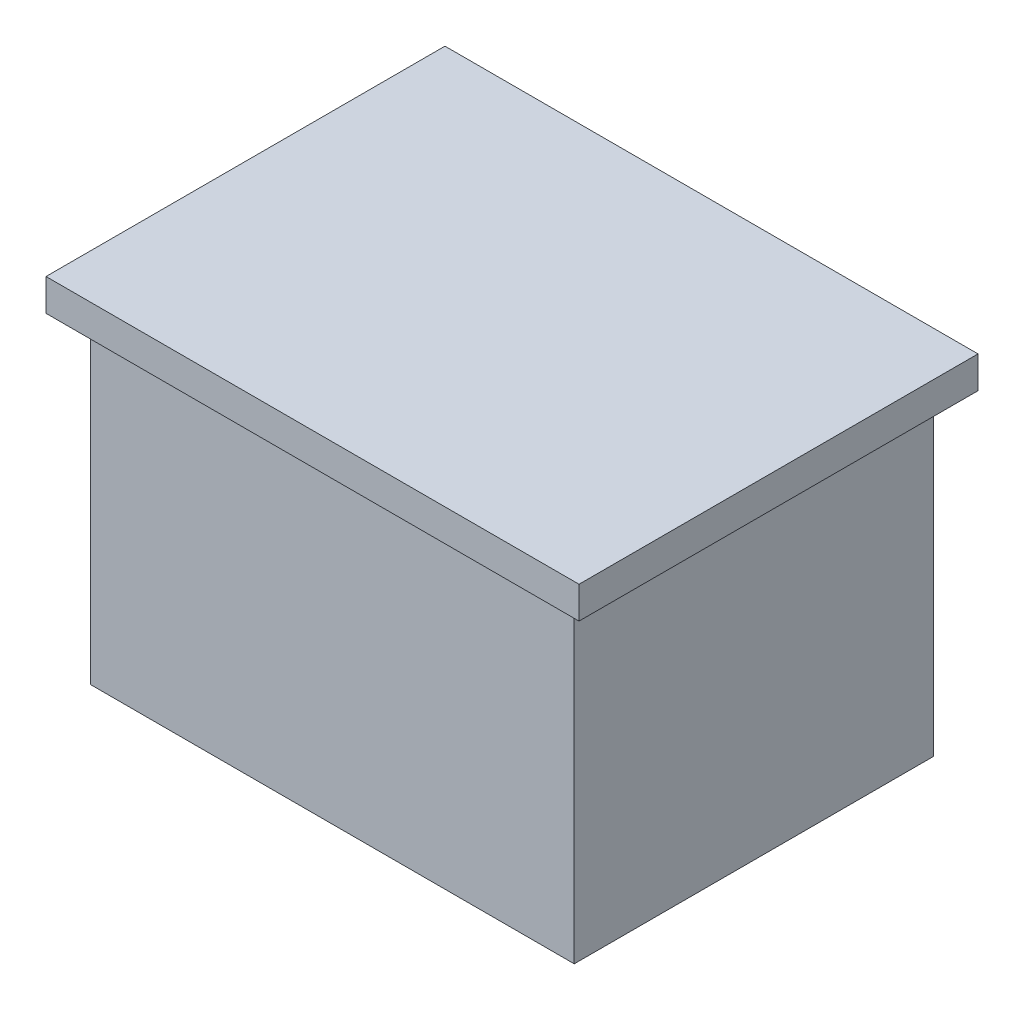
ISO-10303-21;
HEADER;
FILE_DESCRIPTION(('STEP AP214'),'2;1');
FILE_NAME('part.step','',(''),(''),'','','');
FILE_SCHEMA(('AUTOMOTIVE_DESIGN { 1 0 10303 214 1 1 1 1 }'));
ENDSEC;
DATA;
#1=APPLICATION_CONTEXT('core data for automotive mechanical design processes');
#2=APPLICATION_PROTOCOL_DEFINITION('international standard','automotive_design',2000,#1);
#3=PRODUCT_CONTEXT('',#1,'mechanical');
#4=PRODUCT('Part','Part','',(#3));
#5=PRODUCT_RELATED_PRODUCT_CATEGORY('part','',(#4));
#6=PRODUCT_DEFINITION_FORMATION('','',#4);
#7=PRODUCT_DEFINITION_CONTEXT('part definition',#1,'design');
#8=PRODUCT_DEFINITION('design','',#6,#7);
#9=PRODUCT_DEFINITION_SHAPE('','',#8);
#10=(LENGTH_UNIT() NAMED_UNIT(*) SI_UNIT(.MILLI.,.METRE.));
#11=(NAMED_UNIT(*) PLANE_ANGLE_UNIT() SI_UNIT($,.RADIAN.));
#12=(NAMED_UNIT(*) SI_UNIT($,.STERADIAN.) SOLID_ANGLE_UNIT());
#13=UNCERTAINTY_MEASURE_WITH_UNIT(LENGTH_MEASURE(1.E-05),#10,'distance_accuracy_value','');
#14=(GEOMETRIC_REPRESENTATION_CONTEXT(3) GLOBAL_UNCERTAINTY_ASSIGNED_CONTEXT((#13)) GLOBAL_UNIT_ASSIGNED_CONTEXT((#10,
#11,#12)) REPRESENTATION_CONTEXT('',''));
#15=CARTESIAN_POINT('',(0.,0.,0.));
#16=DIRECTION('',(0.,0.,1.));
#17=DIRECTION('',(1.,0.,0.));
#18=AXIS2_PLACEMENT_3D('',#15,#16,#17);
#19=CARTESIAN_POINT('',(15.15,20.,11.25));
#20=DIRECTION('',(-1.,0.,0.));
#21=DIRECTION('',(0.,0.,1.));
#22=AXIS2_PLACEMENT_3D('',#19,#20,#21);
#23=PLANE('',#22);
#24=DIRECTION('',(0.,0.,-1.));
#25=VECTOR('',#24,1.);
#26=CARTESIAN_POINT('',(15.15,0.,11.25));
#27=LINE('',#26,#25);
#28=CARTESIAN_POINT('',(15.15,0.,11.25));
#29=VERTEX_POINT('',#28);
#30=CARTESIAN_POINT('',(15.15,0.,-11.25));
#31=VERTEX_POINT('',#30);
#32=EDGE_CURVE('E141',#29,#31,#27,.T.);
#33=ORIENTED_EDGE('',*,*,#32,.T.);
#34=DIRECTION('',(0.,-1.,0.));
#35=VECTOR('',#34,1.);
#36=CARTESIAN_POINT('',(15.15,20.,-11.25));
#37=LINE('',#36,#35);
#38=CARTESIAN_POINT('',(15.15,20.,-11.25));
#39=VERTEX_POINT('',#38);
#40=EDGE_CURVE('E11',#39,#31,#37,.T.);
#41=ORIENTED_EDGE('',*,*,#40,.F.);
#42=DIRECTION('',(0.,0.,-1.));
#43=VECTOR('',#42,1.);
#44=CARTESIAN_POINT('',(15.15,20.,11.25));
#45=LINE('',#44,#43);
#46=CARTESIAN_POINT('',(15.15,20.,11.25));
#47=VERTEX_POINT('',#46);
#48=EDGE_CURVE('E152',#47,#39,#45,.T.);
#49=ORIENTED_EDGE('',*,*,#48,.F.);
#50=DIRECTION('',(0.,-1.,0.));
#51=VECTOR('',#50,1.);
#52=CARTESIAN_POINT('',(15.15,20.,11.25));
#53=LINE('',#52,#51);
#54=EDGE_CURVE('E165',#47,#29,#53,.T.);
#55=ORIENTED_EDGE('',*,*,#54,.T.);
#56=EDGE_LOOP('',(#33,#41,#49,#55));
#57=FACE_BOUND('',#56,.T.);
#58=ADVANCED_FACE('F39',(#57),#23,.F.);
#59=CARTESIAN_POINT('',(-15.15,20.,-11.25));
#60=DIRECTION('',(0.,0.,1.));
#61=DIRECTION('',(1.,0.,0.));
#62=AXIS2_PLACEMENT_3D('',#59,#60,#61);
#63=PLANE('',#62);
#64=DIRECTION('',(-1.,0.,0.));
#65=VECTOR('',#64,1.);
#66=CARTESIAN_POINT('',(-15.15,0.,-11.25));
#67=LINE('',#66,#65);
#68=CARTESIAN_POINT('',(-15.15,0.,-11.25));
#69=VERTEX_POINT('',#68);
#70=EDGE_CURVE('E146',#31,#69,#67,.T.);
#71=ORIENTED_EDGE('',*,*,#70,.T.);
#72=DIRECTION('',(0.,-1.,0.));
#73=VECTOR('',#72,1.);
#74=CARTESIAN_POINT('',(-15.15,20.,-11.25));
#75=LINE('',#74,#73);
#76=CARTESIAN_POINT('',(-15.15,20.,-11.25));
#77=VERTEX_POINT('',#76);
#78=EDGE_CURVE('E48',#77,#69,#75,.T.);
#79=ORIENTED_EDGE('',*,*,#78,.F.);
#80=DIRECTION('',(-1.,0.,0.));
#81=VECTOR('',#80,1.);
#82=CARTESIAN_POINT('',(-15.15,20.,-11.25));
#83=LINE('',#82,#81);
#84=EDGE_CURVE('E82',#39,#77,#83,.T.);
#85=ORIENTED_EDGE('',*,*,#84,.F.);
#86=ORIENTED_EDGE('',*,*,#40,.T.);
#87=EDGE_LOOP('',(#71,#79,#85,#86));
#88=FACE_BOUND('',#87,.T.);
#89=ADVANCED_FACE('F223',(#88),#63,.F.);
#90=CARTESIAN_POINT('',(-15.15,20.,11.25));
#91=DIRECTION('',(1.,0.,0.));
#92=DIRECTION('',(0.,0.,-1.));
#93=AXIS2_PLACEMENT_3D('',#90,#91,#92);
#94=PLANE('',#93);
#95=DIRECTION('',(0.,0.,1.));
#96=VECTOR('',#95,1.);
#97=CARTESIAN_POINT('',(-15.15,0.,11.25));
#98=LINE('',#97,#96);
#99=CARTESIAN_POINT('',(-15.15,0.,11.25));
#100=VERTEX_POINT('',#99);
#101=EDGE_CURVE('E72',#69,#100,#98,.T.);
#102=ORIENTED_EDGE('',*,*,#101,.T.);
#103=DIRECTION('',(0.,-1.,0.));
#104=VECTOR('',#103,1.);
#105=CARTESIAN_POINT('',(-15.15,20.,11.25));
#106=LINE('',#105,#104);
#107=CARTESIAN_POINT('',(-15.15,20.,11.25));
#108=VERTEX_POINT('',#107);
#109=EDGE_CURVE('E56',#108,#100,#106,.T.);
#110=ORIENTED_EDGE('',*,*,#109,.F.);
#111=DIRECTION('',(0.,0.,1.));
#112=VECTOR('',#111,1.);
#113=CARTESIAN_POINT('',(-15.15,20.,11.25));
#114=LINE('',#113,#112);
#115=EDGE_CURVE('E158',#77,#108,#114,.T.);
#116=ORIENTED_EDGE('',*,*,#115,.F.);
#117=ORIENTED_EDGE('',*,*,#78,.T.);
#118=EDGE_LOOP('',(#102,#110,#116,#117));
#119=FACE_BOUND('',#118,.T.);
#120=ADVANCED_FACE('F177',(#119),#94,.F.);
#121=CARTESIAN_POINT('',(-15.15,20.,11.25));
#122=DIRECTION('',(0.,0.,-1.));
#123=DIRECTION('',(-1.,0.,0.));
#124=AXIS2_PLACEMENT_3D('',#121,#122,#123);
#125=PLANE('',#124);
#126=DIRECTION('',(1.,0.,0.));
#127=VECTOR('',#126,1.);
#128=CARTESIAN_POINT('',(-15.15,0.,11.25));
#129=LINE('',#128,#127);
#130=EDGE_CURVE('E77',#100,#29,#129,.T.);
#131=ORIENTED_EDGE('',*,*,#130,.T.);
#132=ORIENTED_EDGE('',*,*,#54,.F.);
#133=DIRECTION('',(1.,0.,0.));
#134=VECTOR('',#133,1.);
#135=CARTESIAN_POINT('',(-15.15,20.,11.25));
#136=LINE('',#135,#134);
#137=EDGE_CURVE('E162',#108,#47,#136,.T.);
#138=ORIENTED_EDGE('',*,*,#137,.F.);
#139=ORIENTED_EDGE('',*,*,#109,.T.);
#140=EDGE_LOOP('',(#131,#132,#138,#139));
#141=FACE_BOUND('',#140,.T.);
#142=ADVANCED_FACE('F182',(#141),#125,.F.);
#143=CARTESIAN_POINT('',(0.,0.,0.));
#144=DIRECTION('',(0.,-1.,0.));
#145=DIRECTION('',(0.,0.,-1.));
#146=AXIS2_PLACEMENT_3D('',#143,#144,#145);
#147=PLANE('',#146);
#148=ORIENTED_EDGE('',*,*,#32,.F.);
#149=ORIENTED_EDGE('',*,*,#130,.F.);
#150=ORIENTED_EDGE('',*,*,#101,.F.);
#151=ORIENTED_EDGE('',*,*,#70,.F.);
#152=EDGE_LOOP('',(#148,#149,#150,#151));
#153=FACE_BOUND('',#152,.T.);
#154=ADVANCED_FACE('F180',(#153),#147,.T.);
#155=CARTESIAN_POINT('',(16.7,22.,12.5));
#156=DIRECTION('',(-1.,0.,0.));
#157=DIRECTION('',(0.,0.,1.));
#158=AXIS2_PLACEMENT_3D('',#155,#156,#157);
#159=PLANE('',#158);
#160=DIRECTION('',(0.,0.,-1.));
#161=VECTOR('',#160,1.);
#162=CARTESIAN_POINT('',(16.7,20.,12.5));
#163=LINE('',#162,#161);
#164=CARTESIAN_POINT('',(16.7,20.,12.5));
#165=VERTEX_POINT('',#164);
#166=CARTESIAN_POINT('',(16.7,20.,-12.5));
#167=VERTEX_POINT('',#166);
#168=EDGE_CURVE('E139',#165,#167,#163,.T.);
#169=ORIENTED_EDGE('',*,*,#168,.T.);
#170=DIRECTION('',(0.,-1.,0.));
#171=VECTOR('',#170,1.);
#172=CARTESIAN_POINT('',(16.7,22.,-12.5));
#173=LINE('',#172,#171);
#174=CARTESIAN_POINT('',(16.7,22.,-12.5));
#175=VERTEX_POINT('',#174);
#176=EDGE_CURVE('E117',#175,#167,#173,.T.);
#177=ORIENTED_EDGE('',*,*,#176,.F.);
#178=DIRECTION('',(0.,0.,-1.));
#179=VECTOR('',#178,1.);
#180=CARTESIAN_POINT('',(16.7,22.,12.5));
#181=LINE('',#180,#179);
#182=CARTESIAN_POINT('',(16.7,22.,12.5));
#183=VERTEX_POINT('',#182);
#184=EDGE_CURVE('E125',#183,#175,#181,.T.);
#185=ORIENTED_EDGE('',*,*,#184,.F.);
#186=DIRECTION('',(0.,-1.,0.));
#187=VECTOR('',#186,1.);
#188=CARTESIAN_POINT('',(16.7,22.,12.5));
#189=LINE('',#188,#187);
#190=EDGE_CURVE('E203',#183,#165,#189,.T.);
#191=ORIENTED_EDGE('',*,*,#190,.T.);
#192=EDGE_LOOP('',(#169,#177,#185,#191));
#193=FACE_BOUND('',#192,.T.);
#194=ADVANCED_FACE('F137',(#193),#159,.F.);
#195=CARTESIAN_POINT('',(-16.7,22.,-12.5));
#196=DIRECTION('',(0.,0.,1.));
#197=DIRECTION('',(1.,0.,0.));
#198=AXIS2_PLACEMENT_3D('',#195,#196,#197);
#199=PLANE('',#198);
#200=DIRECTION('',(-1.,0.,0.));
#201=VECTOR('',#200,1.);
#202=CARTESIAN_POINT('',(-16.7,20.,-12.5));
#203=LINE('',#202,#201);
#204=CARTESIAN_POINT('',(-16.7,20.,-12.5));
#205=VERTEX_POINT('',#204);
#206=EDGE_CURVE('E190',#167,#205,#203,.T.);
#207=ORIENTED_EDGE('',*,*,#206,.T.);
#208=DIRECTION('',(0.,-1.,0.));
#209=VECTOR('',#208,1.);
#210=CARTESIAN_POINT('',(-16.7,22.,-12.5));
#211=LINE('',#210,#209);
#212=CARTESIAN_POINT('',(-16.7,22.,-12.5));
#213=VERTEX_POINT('',#212);
#214=EDGE_CURVE('E120',#213,#205,#211,.T.);
#215=ORIENTED_EDGE('',*,*,#214,.F.);
#216=DIRECTION('',(-1.,0.,0.));
#217=VECTOR('',#216,1.);
#218=CARTESIAN_POINT('',(-16.7,22.,-12.5));
#219=LINE('',#218,#217);
#220=EDGE_CURVE('E113',#175,#213,#219,.T.);
#221=ORIENTED_EDGE('',*,*,#220,.F.);
#222=ORIENTED_EDGE('',*,*,#176,.T.);
#223=EDGE_LOOP('',(#207,#215,#221,#222));
#224=FACE_BOUND('',#223,.T.);
#225=ADVANCED_FACE('F115',(#224),#199,.F.);
#226=CARTESIAN_POINT('',(-16.7,22.,12.5));
#227=DIRECTION('',(1.,0.,0.));
#228=DIRECTION('',(0.,0.,-1.));
#229=AXIS2_PLACEMENT_3D('',#226,#227,#228);
#230=PLANE('',#229);
#231=DIRECTION('',(0.,0.,1.));
#232=VECTOR('',#231,1.);
#233=CARTESIAN_POINT('',(-16.7,20.,12.5));
#234=LINE('',#233,#232);
#235=CARTESIAN_POINT('',(-16.7,20.,12.5));
#236=VERTEX_POINT('',#235);
#237=EDGE_CURVE('E194',#205,#236,#234,.T.);
#238=ORIENTED_EDGE('',*,*,#237,.T.);
#239=DIRECTION('',(0.,-1.,0.));
#240=VECTOR('',#239,1.);
#241=CARTESIAN_POINT('',(-16.7,22.,12.5));
#242=LINE('',#241,#240);
#243=CARTESIAN_POINT('',(-16.7,22.,12.5));
#244=VERTEX_POINT('',#243);
#245=EDGE_CURVE('E148',#244,#236,#242,.T.);
#246=ORIENTED_EDGE('',*,*,#245,.F.);
#247=DIRECTION('',(0.,0.,1.));
#248=VECTOR('',#247,1.);
#249=CARTESIAN_POINT('',(-16.7,22.,12.5));
#250=LINE('',#249,#248);
#251=EDGE_CURVE('E124',#213,#244,#250,.T.);
#252=ORIENTED_EDGE('',*,*,#251,.F.);
#253=ORIENTED_EDGE('',*,*,#214,.T.);
#254=EDGE_LOOP('',(#238,#246,#252,#253));
#255=FACE_BOUND('',#254,.T.);
#256=ADVANCED_FACE('F211',(#255),#230,.F.);
#257=CARTESIAN_POINT('',(-16.7,22.,12.5));
#258=DIRECTION('',(0.,0.,-1.));
#259=DIRECTION('',(-1.,0.,0.));
#260=AXIS2_PLACEMENT_3D('',#257,#258,#259);
#261=PLANE('',#260);
#262=DIRECTION('',(1.,0.,0.));
#263=VECTOR('',#262,1.);
#264=CARTESIAN_POINT('',(-16.7,20.,12.5));
#265=LINE('',#264,#263);
#266=EDGE_CURVE('E135',#236,#165,#265,.T.);
#267=ORIENTED_EDGE('',*,*,#266,.T.);
#268=ORIENTED_EDGE('',*,*,#190,.F.);
#269=DIRECTION('',(1.,0.,0.));
#270=VECTOR('',#269,1.);
#271=CARTESIAN_POINT('',(-16.7,22.,12.5));
#272=LINE('',#271,#270);
#273=EDGE_CURVE('E130',#244,#183,#272,.T.);
#274=ORIENTED_EDGE('',*,*,#273,.F.);
#275=ORIENTED_EDGE('',*,*,#245,.T.);
#276=EDGE_LOOP('',(#267,#268,#274,#275));
#277=FACE_BOUND('',#276,.T.);
#278=ADVANCED_FACE('F209',(#277),#261,.F.);
#279=CARTESIAN_POINT('',(0.,22.,0.));
#280=DIRECTION('',(0.,-1.,0.));
#281=DIRECTION('',(0.,0.,-1.));
#282=AXIS2_PLACEMENT_3D('',#279,#280,#281);
#283=PLANE('',#282);
#284=ORIENTED_EDGE('',*,*,#184,.T.);
#285=ORIENTED_EDGE('',*,*,#220,.T.);
#286=ORIENTED_EDGE('',*,*,#251,.T.);
#287=ORIENTED_EDGE('',*,*,#273,.T.);
#288=EDGE_LOOP('',(#284,#285,#286,#287));
#289=FACE_BOUND('',#288,.T.);
#290=ADVANCED_FACE('F128',(#289),#283,.F.);
#291=CARTESIAN_POINT('',(0.,20.,0.));
#292=DIRECTION('',(0.,-1.,0.));
#293=DIRECTION('',(0.,0.,-1.));
#294=AXIS2_PLACEMENT_3D('',#291,#292,#293);
#295=PLANE('',#294);
#296=ORIENTED_EDGE('',*,*,#137,.T.);
#297=ORIENTED_EDGE('',*,*,#48,.T.);
#298=ORIENTED_EDGE('',*,*,#84,.T.);
#299=ORIENTED_EDGE('',*,*,#115,.T.);
#300=EDGE_LOOP('',(#296,#297,#298,#299));
#301=FACE_BOUND('',#300,.T.);
#302=ORIENTED_EDGE('',*,*,#168,.F.);
#303=ORIENTED_EDGE('',*,*,#266,.F.);
#304=ORIENTED_EDGE('',*,*,#237,.F.);
#305=ORIENTED_EDGE('',*,*,#206,.F.);
#306=EDGE_LOOP('',(#302,#303,#304,#305));
#307=FACE_BOUND('',#306,.T.);
#308=ADVANCED_FACE('F184',(#301,#307),#295,.T.);
#309=CLOSED_SHELL('',(#58,#89,#120,#142,#154,#194,#225,#256,#278,#290,#308));
#310=MANIFOLD_SOLID_BREP('B2',#309);
#311=ADVANCED_BREP_SHAPE_REPRESENTATION('',(#18,#310),#14);
#312=SHAPE_DEFINITION_REPRESENTATION(#9,#311);
ENDSEC;
END-ISO-10303-21;
